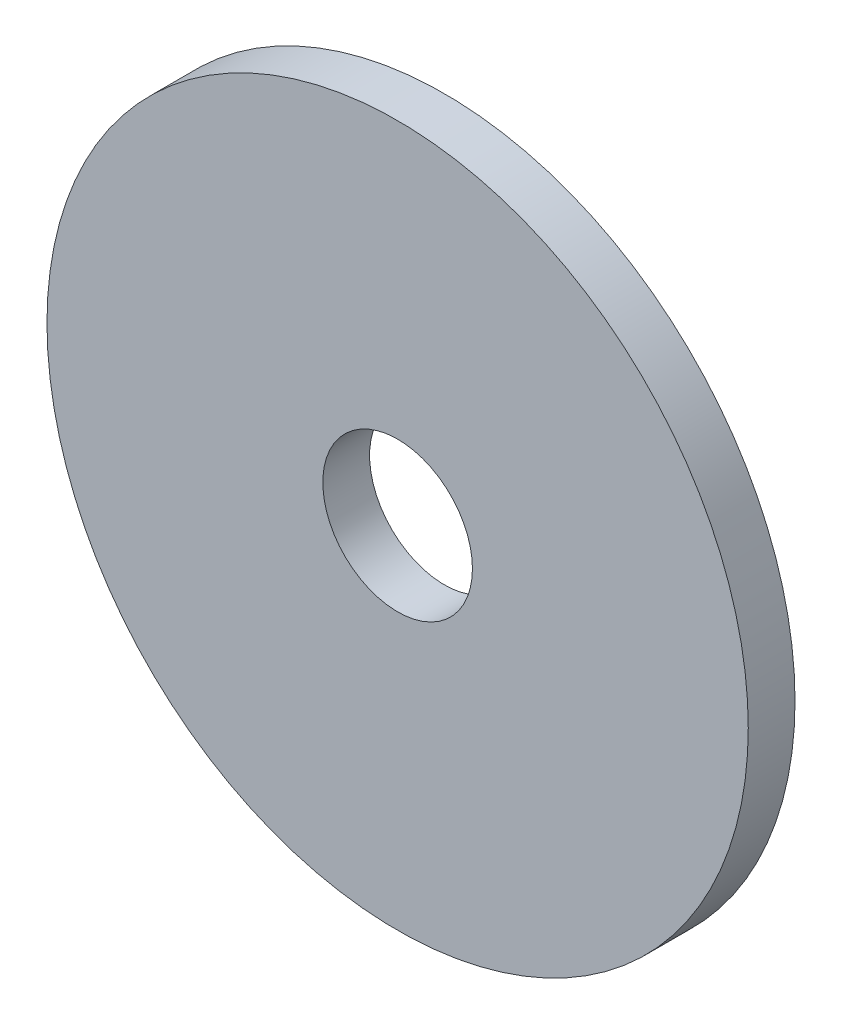
ISO-10303-21;
HEADER;
FILE_DESCRIPTION(('STEP AP214'),'2;1');
FILE_NAME('part.step','',(''),(''),'','','');
FILE_SCHEMA(('AUTOMOTIVE_DESIGN { 1 0 10303 214 1 1 1 1 }'));
ENDSEC;
DATA;
#1=APPLICATION_CONTEXT('core data for automotive mechanical design processes');
#2=APPLICATION_PROTOCOL_DEFINITION('international standard','automotive_design',2000,#1);
#3=PRODUCT_CONTEXT('',#1,'mechanical');
#4=PRODUCT('Part','Part','',(#3));
#5=PRODUCT_RELATED_PRODUCT_CATEGORY('part','',(#4));
#6=PRODUCT_DEFINITION_FORMATION('','',#4);
#7=PRODUCT_DEFINITION_CONTEXT('part definition',#1,'design');
#8=PRODUCT_DEFINITION('design','',#6,#7);
#9=PRODUCT_DEFINITION_SHAPE('','',#8);
#10=(LENGTH_UNIT() NAMED_UNIT(*) SI_UNIT(.MILLI.,.METRE.));
#11=(NAMED_UNIT(*) PLANE_ANGLE_UNIT() SI_UNIT($,.RADIAN.));
#12=(NAMED_UNIT(*) SI_UNIT($,.STERADIAN.) SOLID_ANGLE_UNIT());
#13=UNCERTAINTY_MEASURE_WITH_UNIT(LENGTH_MEASURE(1.E-05),#10,'distance_accuracy_value','');
#14=(GEOMETRIC_REPRESENTATION_CONTEXT(3) GLOBAL_UNCERTAINTY_ASSIGNED_CONTEXT((#13)) GLOBAL_UNIT_ASSIGNED_CONTEXT((#10,
#11,#12)) REPRESENTATION_CONTEXT('',''));
#15=CARTESIAN_POINT('',(0.,0.,0.));
#16=DIRECTION('',(0.,0.,1.));
#17=DIRECTION('',(1.,0.,0.));
#18=AXIS2_PLACEMENT_3D('',#15,#16,#17);
#19=CARTESIAN_POINT('',(0.,0.,1.));
#20=DIRECTION('',(0.,0.,-1.));
#21=DIRECTION('',(-1.,0.,0.));
#22=AXIS2_PLACEMENT_3D('',#19,#20,#21);
#23=CYLINDRICAL_SURFACE('',#22,7.5);
#24=CARTESIAN_POINT('',(0.,0.,1.));
#25=DIRECTION('',(0.,0.,1.));
#26=DIRECTION('',(1.,0.,0.));
#27=AXIS2_PLACEMENT_3D('',#24,#25,#26);
#28=CIRCLE('',#27,7.5);
#29=CARTESIAN_POINT('',(7.5,0.,1.));
#30=VERTEX_POINT('',#29);
#31=EDGE_CURVE('E10',#30,#30,#28,.T.);
#32=ORIENTED_EDGE('',*,*,#31,.F.);
#33=EDGE_LOOP('',(#32));
#34=FACE_BOUND('',#33,.T.);
#35=CARTESIAN_POINT('',(0.,0.,0.));
#36=DIRECTION('',(0.,0.,1.));
#37=DIRECTION('',(1.,0.,0.));
#38=AXIS2_PLACEMENT_3D('',#35,#36,#37);
#39=CIRCLE('',#38,7.5);
#40=CARTESIAN_POINT('',(7.5,0.,0.));
#41=VERTEX_POINT('',#40);
#42=EDGE_CURVE('E39',#41,#41,#39,.T.);
#43=ORIENTED_EDGE('',*,*,#42,.T.);
#44=EDGE_LOOP('',(#43));
#45=FACE_BOUND('',#44,.T.);
#46=ADVANCED_FACE('F36',(#34,#45),#23,.T.);
#47=CARTESIAN_POINT('',(0.,0.,1.));
#48=DIRECTION('',(0.,0.,1.));
#49=DIRECTION('',(1.,0.,0.));
#50=AXIS2_PLACEMENT_3D('',#47,#48,#49);
#51=PLANE('',#50);
#52=CARTESIAN_POINT('',(0.,0.,1.));
#53=DIRECTION('',(0.,0.,1.));
#54=DIRECTION('',(1.,0.,0.));
#55=AXIS2_PLACEMENT_3D('',#52,#53,#54);
#56=CIRCLE('',#55,1.6);
#57=CARTESIAN_POINT('',(1.6,0.,1.));
#58=VERTEX_POINT('',#57);
#59=EDGE_CURVE('E54',#58,#58,#56,.T.);
#60=ORIENTED_EDGE('',*,*,#59,.F.);
#61=EDGE_LOOP('',(#60));
#62=FACE_BOUND('',#61,.T.);
#63=ORIENTED_EDGE('',*,*,#31,.T.);
#64=EDGE_LOOP('',(#63));
#65=FACE_BOUND('',#64,.T.);
#66=ADVANCED_FACE('F63',(#62,#65),#51,.T.);
#67=CARTESIAN_POINT('',(0.,0.,0.));
#68=DIRECTION('',(0.,0.,1.));
#69=DIRECTION('',(1.,0.,0.));
#70=AXIS2_PLACEMENT_3D('',#67,#68,#69);
#71=PLANE('',#70);
#72=CARTESIAN_POINT('',(0.,0.,0.));
#73=DIRECTION('',(0.,0.,1.));
#74=DIRECTION('',(1.,0.,0.));
#75=AXIS2_PLACEMENT_3D('',#72,#73,#74);
#76=CIRCLE('',#75,1.6);
#77=CARTESIAN_POINT('',(1.6,0.,0.));
#78=VERTEX_POINT('',#77);
#79=EDGE_CURVE('E49',#78,#78,#76,.T.);
#80=ORIENTED_EDGE('',*,*,#79,.T.);
#81=EDGE_LOOP('',(#80));
#82=FACE_BOUND('',#81,.T.);
#83=ORIENTED_EDGE('',*,*,#42,.F.);
#84=EDGE_LOOP('',(#83));
#85=FACE_BOUND('',#84,.T.);
#86=ADVANCED_FACE('F65',(#82,#85),#71,.F.);
#87=CARTESIAN_POINT('',(0.,0.,1.));
#88=DIRECTION('',(0.,0.,1.));
#89=DIRECTION('',(1.,0.,0.));
#90=AXIS2_PLACEMENT_3D('',#87,#88,#89);
#91=CYLINDRICAL_SURFACE('',#90,1.6);
#92=ORIENTED_EDGE('',*,*,#59,.T.);
#93=EDGE_LOOP('',(#92));
#94=FACE_BOUND('',#93,.T.);
#95=ORIENTED_EDGE('',*,*,#79,.F.);
#96=EDGE_LOOP('',(#95));
#97=FACE_BOUND('',#96,.T.);
#98=ADVANCED_FACE('F60',(#94,#97),#91,.F.);
#99=CLOSED_SHELL('',(#46,#66,#86,#98));
#100=MANIFOLD_SOLID_BREP('B2',#99);
#101=ADVANCED_BREP_SHAPE_REPRESENTATION('',(#18,#100),#14);
#102=SHAPE_DEFINITION_REPRESENTATION(#9,#101);
ENDSEC;
END-ISO-10303-21;
